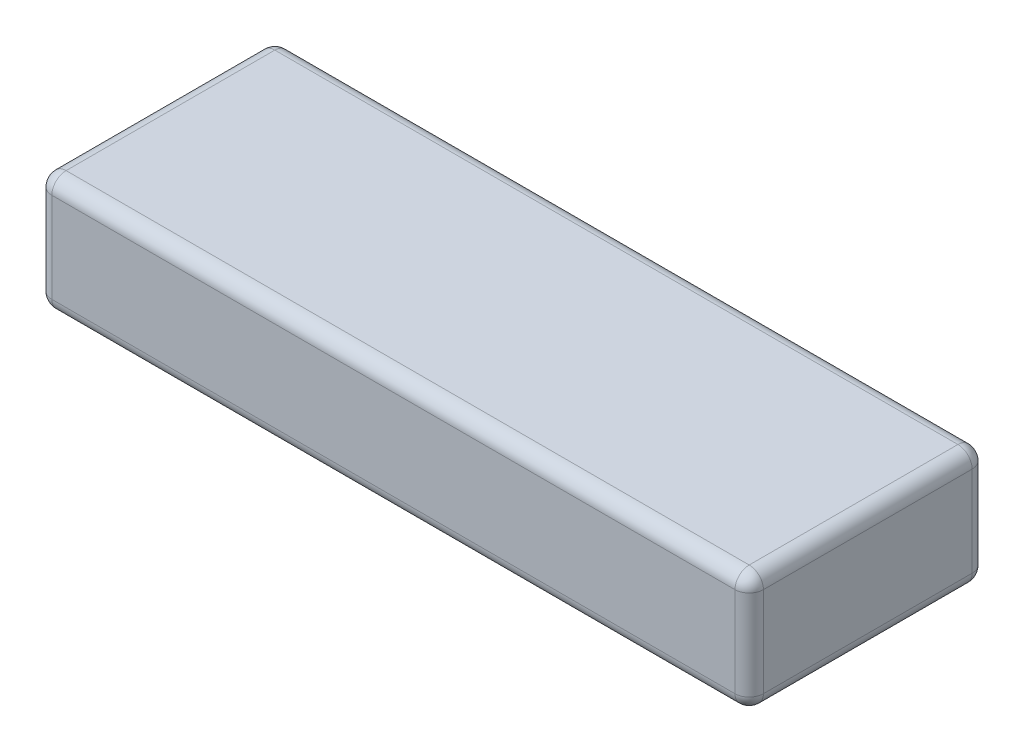
ISO-10303-21;
HEADER;
FILE_DESCRIPTION(('STEP AP214'),'2;1');
FILE_NAME('part.step','',(''),(''),'','','');
FILE_SCHEMA(('AUTOMOTIVE_DESIGN { 1 0 10303 214 1 1 1 1 }'));
ENDSEC;
DATA;
#1=APPLICATION_CONTEXT('core data for automotive mechanical design processes');
#2=APPLICATION_PROTOCOL_DEFINITION('international standard','automotive_design',2000,#1);
#3=PRODUCT_CONTEXT('',#1,'mechanical');
#4=PRODUCT('Part','Part','',(#3));
#5=PRODUCT_RELATED_PRODUCT_CATEGORY('part','',(#4));
#6=PRODUCT_DEFINITION_FORMATION('','',#4);
#7=PRODUCT_DEFINITION_CONTEXT('part definition',#1,'design');
#8=PRODUCT_DEFINITION('design','',#6,#7);
#9=PRODUCT_DEFINITION_SHAPE('','',#8);
#10=(LENGTH_UNIT() NAMED_UNIT(*) SI_UNIT(.MILLI.,.METRE.));
#11=(NAMED_UNIT(*) PLANE_ANGLE_UNIT() SI_UNIT($,.RADIAN.));
#12=(NAMED_UNIT(*) SI_UNIT($,.STERADIAN.) SOLID_ANGLE_UNIT());
#13=UNCERTAINTY_MEASURE_WITH_UNIT(LENGTH_MEASURE(1.E-05),#10,'distance_accuracy_value','');
#14=(GEOMETRIC_REPRESENTATION_CONTEXT(3) GLOBAL_UNCERTAINTY_ASSIGNED_CONTEXT((#13)) GLOBAL_UNIT_ASSIGNED_CONTEXT((#10,
#11,#12)) REPRESENTATION_CONTEXT('',''));
#15=CARTESIAN_POINT('',(0.,0.,0.));
#16=DIRECTION('',(0.,0.,1.));
#17=DIRECTION('',(1.,0.,0.));
#18=AXIS2_PLACEMENT_3D('',#15,#16,#17);
#19=CARTESIAN_POINT('',(0.,25.,0.));
#20=DIRECTION('',(1.,0.,0.));
#21=DIRECTION('',(0.,0.,-1.));
#22=AXIS2_PLACEMENT_3D('',#19,#20,#21);
#23=PLANE('',#22);
#24=DIRECTION('',(0.,0.,1.));
#25=VECTOR('',#24,1.);
#26=CARTESIAN_POINT('',(0.,22.,0.));
#27=LINE('',#26,#25);
#28=CARTESIAN_POINT('',(0.,22.,47.));
#29=VERTEX_POINT('',#28);
#30=CARTESIAN_POINT('',(0.,22.,3.));
#31=VERTEX_POINT('',#30);
#32=EDGE_CURVE('E273',#29,#31,#27,.F.);
#33=ORIENTED_EDGE('',*,*,#32,.T.);
#34=DIRECTION('',(0.,-1.,0.));
#35=VECTOR('',#34,1.);
#36=CARTESIAN_POINT('',(0.,25.,3.));
#37=LINE('',#36,#35);
#38=CARTESIAN_POINT('',(0.,3.,3.));
#39=VERTEX_POINT('',#38);
#40=EDGE_CURVE('E157',#31,#39,#37,.T.);
#41=ORIENTED_EDGE('',*,*,#40,.T.);
#42=DIRECTION('',(0.,0.,1.));
#43=VECTOR('',#42,1.);
#44=CARTESIAN_POINT('',(0.,3.,0.));
#45=LINE('',#44,#43);
#46=CARTESIAN_POINT('',(0.,3.,47.));
#47=VERTEX_POINT('',#46);
#48=EDGE_CURVE('E281',#39,#47,#45,.T.);
#49=ORIENTED_EDGE('',*,*,#48,.T.);
#50=DIRECTION('',(0.,-1.,0.));
#51=VECTOR('',#50,1.);
#52=CARTESIAN_POINT('',(0.,25.,47.));
#53=LINE('',#52,#51);
#54=EDGE_CURVE('E275',#47,#29,#53,.F.);
#55=ORIENTED_EDGE('',*,*,#54,.T.);
#56=EDGE_LOOP('',(#33,#41,#49,#55));
#57=FACE_BOUND('',#56,.T.);
#58=ADVANCED_FACE('F37',(#57),#23,.F.);
#59=CARTESIAN_POINT('',(0.,25.,50.));
#60=DIRECTION('',(0.,0.,-1.));
#61=DIRECTION('',(-1.,0.,0.));
#62=AXIS2_PLACEMENT_3D('',#59,#60,#61);
#63=PLANE('',#62);
#64=DIRECTION('',(1.,0.,0.));
#65=VECTOR('',#64,1.);
#66=CARTESIAN_POINT('',(0.,22.,50.));
#67=LINE('',#66,#65);
#68=CARTESIAN_POINT('',(147.,22.,50.));
#69=VERTEX_POINT('',#68);
#70=CARTESIAN_POINT('',(3.00000000000001,22.,50.));
#71=VERTEX_POINT('',#70);
#72=EDGE_CURVE('E284',#69,#71,#67,.F.);
#73=ORIENTED_EDGE('',*,*,#72,.T.);
#74=DIRECTION('',(0.,-1.,0.));
#75=VECTOR('',#74,1.);
#76=CARTESIAN_POINT('',(3.00000000000001,25.,50.));
#77=LINE('',#76,#75);
#78=CARTESIAN_POINT('',(3.00000000000001,3.,50.));
#79=VERTEX_POINT('',#78);
#80=EDGE_CURVE('E227',#71,#79,#77,.T.);
#81=ORIENTED_EDGE('',*,*,#80,.T.);
#82=DIRECTION('',(1.,0.,0.));
#83=VECTOR('',#82,1.);
#84=CARTESIAN_POINT('',(0.,3.,50.));
#85=LINE('',#84,#83);
#86=CARTESIAN_POINT('',(147.,3.,50.));
#87=VERTEX_POINT('',#86);
#88=EDGE_CURVE('E287',#79,#87,#85,.T.);
#89=ORIENTED_EDGE('',*,*,#88,.T.);
#90=DIRECTION('',(0.,-1.,0.));
#91=VECTOR('',#90,1.);
#92=CARTESIAN_POINT('',(147.,25.,50.));
#93=LINE('',#92,#91);
#94=EDGE_CURVE('E217',#87,#69,#93,.F.);
#95=ORIENTED_EDGE('',*,*,#94,.T.);
#96=EDGE_LOOP('',(#73,#81,#89,#95));
#97=FACE_BOUND('',#96,.T.);
#98=ADVANCED_FACE('F291',(#97),#63,.F.);
#99=CARTESIAN_POINT('',(150.,25.,0.));
#100=DIRECTION('',(-1.,0.,0.));
#101=DIRECTION('',(0.,0.,1.));
#102=AXIS2_PLACEMENT_3D('',#99,#100,#101);
#103=PLANE('',#102);
#104=DIRECTION('',(0.,0.,-1.));
#105=VECTOR('',#104,1.);
#106=CARTESIAN_POINT('',(150.,3.,0.));
#107=LINE('',#106,#105);
#108=CARTESIAN_POINT('',(150.,3.,47.));
#109=VERTEX_POINT('',#108);
#110=CARTESIAN_POINT('',(150.,3.,3.));
#111=VERTEX_POINT('',#110);
#112=EDGE_CURVE('E222',#109,#111,#107,.T.);
#113=ORIENTED_EDGE('',*,*,#112,.T.);
#114=DIRECTION('',(0.,-1.,0.));
#115=VECTOR('',#114,1.);
#116=CARTESIAN_POINT('',(150.,25.,3.));
#117=LINE('',#116,#115);
#118=CARTESIAN_POINT('',(150.,22.,3.));
#119=VERTEX_POINT('',#118);
#120=EDGE_CURVE('E225',#111,#119,#117,.F.);
#121=ORIENTED_EDGE('',*,*,#120,.T.);
#122=DIRECTION('',(0.,0.,-1.));
#123=VECTOR('',#122,1.);
#124=CARTESIAN_POINT('',(150.,22.,50.));
#125=LINE('',#124,#123);
#126=CARTESIAN_POINT('',(150.,22.,47.));
#127=VERTEX_POINT('',#126);
#128=EDGE_CURVE('E223',#119,#127,#125,.F.);
#129=ORIENTED_EDGE('',*,*,#128,.T.);
#130=DIRECTION('',(0.,-1.,0.));
#131=VECTOR('',#130,1.);
#132=CARTESIAN_POINT('',(150.,25.,47.));
#133=LINE('',#132,#131);
#134=EDGE_CURVE('E219',#127,#109,#133,.T.);
#135=ORIENTED_EDGE('',*,*,#134,.T.);
#136=EDGE_LOOP('',(#113,#121,#129,#135));
#137=FACE_BOUND('',#136,.T.);
#138=ADVANCED_FACE('F305',(#137),#103,.F.);
#139=CARTESIAN_POINT('',(0.,25.,0.));
#140=DIRECTION('',(0.,0.,1.));
#141=DIRECTION('',(1.,0.,0.));
#142=AXIS2_PLACEMENT_3D('',#139,#140,#141);
#143=PLANE('',#142);
#144=DIRECTION('',(0.,-1.,0.));
#145=VECTOR('',#144,1.);
#146=CARTESIAN_POINT('',(147.,25.,0.));
#147=LINE('',#146,#145);
#148=CARTESIAN_POINT('',(147.,22.,0.));
#149=VERTEX_POINT('',#148);
#150=CARTESIAN_POINT('',(147.,3.,0.));
#151=VERTEX_POINT('',#150);
#152=EDGE_CURVE('E138',#149,#151,#147,.T.);
#153=ORIENTED_EDGE('',*,*,#152,.T.);
#154=DIRECTION('',(-1.,0.,0.));
#155=VECTOR('',#154,1.);
#156=CARTESIAN_POINT('',(0.,3.,0.));
#157=LINE('',#156,#155);
#158=CARTESIAN_POINT('',(3.,3.,0.));
#159=VERTEX_POINT('',#158);
#160=EDGE_CURVE('E134',#151,#159,#157,.T.);
#161=ORIENTED_EDGE('',*,*,#160,.T.);
#162=DIRECTION('',(0.,-1.,0.));
#163=VECTOR('',#162,1.);
#164=CARTESIAN_POINT('',(3.,25.,0.));
#165=LINE('',#164,#163);
#166=CARTESIAN_POINT('',(3.,22.,0.));
#167=VERTEX_POINT('',#166);
#168=EDGE_CURVE('E129',#159,#167,#165,.F.);
#169=ORIENTED_EDGE('',*,*,#168,.T.);
#170=DIRECTION('',(-1.,0.,0.));
#171=VECTOR('',#170,1.);
#172=CARTESIAN_POINT('',(150.,22.,0.));
#173=LINE('',#172,#171);
#174=EDGE_CURVE('E132',#167,#149,#173,.F.);
#175=ORIENTED_EDGE('',*,*,#174,.T.);
#176=EDGE_LOOP('',(#153,#161,#169,#175));
#177=FACE_BOUND('',#176,.T.);
#178=ADVANCED_FACE('F131',(#177),#143,.F.);
#179=CARTESIAN_POINT('',(0.,25.,0.));
#180=DIRECTION('',(0.,1.,0.));
#181=DIRECTION('',(0.,0.,1.));
#182=AXIS2_PLACEMENT_3D('',#179,#180,#181);
#183=PLANE('',#182);
#184=DIRECTION('',(1.,0.,0.));
#185=VECTOR('',#184,1.);
#186=CARTESIAN_POINT('',(150.,25.,47.));
#187=LINE('',#186,#185);
#188=CARTESIAN_POINT('',(3.00000000000001,25.,47.));
#189=VERTEX_POINT('',#188);
#190=CARTESIAN_POINT('',(147.,25.,47.));
#191=VERTEX_POINT('',#190);
#192=EDGE_CURVE('E233',#189,#191,#187,.T.);
#193=ORIENTED_EDGE('',*,*,#192,.T.);
#194=DIRECTION('',(0.,0.,-1.));
#195=VECTOR('',#194,1.);
#196=CARTESIAN_POINT('',(147.,25.,0.));
#197=LINE('',#196,#195);
#198=CARTESIAN_POINT('',(147.,25.,3.));
#199=VERTEX_POINT('',#198);
#200=EDGE_CURVE('E11',#191,#199,#197,.T.);
#201=ORIENTED_EDGE('',*,*,#200,.T.);
#202=DIRECTION('',(-1.,0.,0.));
#203=VECTOR('',#202,1.);
#204=CARTESIAN_POINT('',(0.,25.,3.));
#205=LINE('',#204,#203);
#206=CARTESIAN_POINT('',(3.,25.,3.));
#207=VERTEX_POINT('',#206);
#208=EDGE_CURVE('E46',#199,#207,#205,.T.);
#209=ORIENTED_EDGE('',*,*,#208,.T.);
#210=DIRECTION('',(0.,0.,1.));
#211=VECTOR('',#210,1.);
#212=CARTESIAN_POINT('',(3.00000000000001,25.,50.));
#213=LINE('',#212,#211);
#214=EDGE_CURVE('E235',#207,#189,#213,.T.);
#215=ORIENTED_EDGE('',*,*,#214,.T.);
#216=EDGE_LOOP('',(#193,#201,#209,#215));
#217=FACE_BOUND('',#216,.T.);
#218=ADVANCED_FACE('F313',(#217),#183,.T.);
#219=CARTESIAN_POINT('',(0.,0.,0.));
#220=DIRECTION('',(0.,1.,0.));
#221=DIRECTION('',(0.,0.,1.));
#222=AXIS2_PLACEMENT_3D('',#219,#220,#221);
#223=PLANE('',#222);
#224=DIRECTION('',(0.,0.,1.));
#225=VECTOR('',#224,1.);
#226=CARTESIAN_POINT('',(3.,0.,0.));
#227=LINE('',#226,#225);
#228=CARTESIAN_POINT('',(3.00000000000001,0.,47.));
#229=VERTEX_POINT('',#228);
#230=CARTESIAN_POINT('',(3.,0.,3.));
#231=VERTEX_POINT('',#230);
#232=EDGE_CURVE('E269',#229,#231,#227,.F.);
#233=ORIENTED_EDGE('',*,*,#232,.T.);
#234=DIRECTION('',(-1.,0.,0.));
#235=VECTOR('',#234,1.);
#236=CARTESIAN_POINT('',(0.,0.,3.));
#237=LINE('',#236,#235);
#238=CARTESIAN_POINT('',(147.,0.,3.));
#239=VERTEX_POINT('',#238);
#240=EDGE_CURVE('E266',#231,#239,#237,.F.);
#241=ORIENTED_EDGE('',*,*,#240,.T.);
#242=DIRECTION('',(0.,0.,-1.));
#243=VECTOR('',#242,1.);
#244=CARTESIAN_POINT('',(147.,0.,0.));
#245=LINE('',#244,#243);
#246=CARTESIAN_POINT('',(147.,0.,47.));
#247=VERTEX_POINT('',#246);
#248=EDGE_CURVE('E258',#239,#247,#245,.F.);
#249=ORIENTED_EDGE('',*,*,#248,.T.);
#250=DIRECTION('',(1.,0.,0.));
#251=VECTOR('',#250,1.);
#252=CARTESIAN_POINT('',(0.,0.,47.));
#253=LINE('',#252,#251);
#254=EDGE_CURVE('E263',#247,#229,#253,.F.);
#255=ORIENTED_EDGE('',*,*,#254,.T.);
#256=EDGE_LOOP('',(#233,#241,#249,#255));
#257=FACE_BOUND('',#256,.T.);
#258=ADVANCED_FACE('F267',(#257),#223,.F.);
#259=CARTESIAN_POINT('',(0.,22.,47.));
#260=DIRECTION('',(-1.,0.,0.));
#261=DIRECTION('',(0.,0.,1.));
#262=AXIS2_PLACEMENT_3D('',#259,#260,#261);
#263=CYLINDRICAL_SURFACE('',#262,3.);
#264=CARTESIAN_POINT('',(147.,22.,47.));
#265=DIRECTION('',(1.,0.,0.));
#266=DIRECTION('',(0.,0.,-1.));
#267=AXIS2_PLACEMENT_3D('',#264,#265,#266);
#268=CIRCLE('',#267,3.);
#269=EDGE_CURVE('E41',#191,#69,#268,.T.);
#270=ORIENTED_EDGE('',*,*,#269,.F.);
#271=ORIENTED_EDGE('',*,*,#192,.F.);
#272=CARTESIAN_POINT('',(3.00000000000001,22.,47.));
#273=DIRECTION('',(-1.,0.,0.));
#274=DIRECTION('',(0.,0.,1.));
#275=AXIS2_PLACEMENT_3D('',#272,#273,#274);
#276=CIRCLE('',#275,3.);
#277=EDGE_CURVE('E196',#71,#189,#276,.T.);
#278=ORIENTED_EDGE('',*,*,#277,.F.);
#279=ORIENTED_EDGE('',*,*,#72,.F.);
#280=EDGE_LOOP('',(#270,#271,#278,#279));
#281=FACE_BOUND('',#280,.T.);
#282=ADVANCED_FACE('F39',(#281),#263,.T.);
#283=CARTESIAN_POINT('',(147.,22.,47.));
#284=DIRECTION('',(0.,0.,1.));
#285=DIRECTION('',(1.,0.,0.));
#286=AXIS2_PLACEMENT_3D('',#283,#284,#285);
#287=SPHERICAL_SURFACE('',#286,3.);
#288=CARTESIAN_POINT('',(147.,22.,47.));
#289=DIRECTION('',(0.,0.,1.));
#290=DIRECTION('',(1.,0.,0.));
#291=AXIS2_PLACEMENT_3D('',#288,#289,#290);
#292=CIRCLE('',#291,3.);
#293=EDGE_CURVE('E191',#191,#127,#292,.F.);
#294=ORIENTED_EDGE('',*,*,#293,.F.);
#295=ORIENTED_EDGE('',*,*,#269,.T.);
#296=CARTESIAN_POINT('',(147.,22.,47.));
#297=DIRECTION('',(0.,1.,0.));
#298=DIRECTION('',(0.,0.,1.));
#299=AXIS2_PLACEMENT_3D('',#296,#297,#298);
#300=CIRCLE('',#299,3.);
#301=EDGE_CURVE('E194',#127,#69,#300,.F.);
#302=ORIENTED_EDGE('',*,*,#301,.F.);
#303=EDGE_LOOP('',(#294,#295,#302));
#304=FACE_BOUND('',#303,.T.);
#305=ADVANCED_FACE('F207',(#304),#287,.T.);
#306=CARTESIAN_POINT('',(3.00000000000001,22.,47.));
#307=DIRECTION('',(0.,0.,1.));
#308=DIRECTION('',(1.,0.,0.));
#309=AXIS2_PLACEMENT_3D('',#306,#307,#308);
#310=SPHERICAL_SURFACE('',#309,3.);
#311=CARTESIAN_POINT('',(3.00000000000001,22.,47.));
#312=DIRECTION('',(0.,1.,0.));
#313=DIRECTION('',(0.,0.,1.));
#314=AXIS2_PLACEMENT_3D('',#311,#312,#313);
#315=CIRCLE('',#314,3.);
#316=EDGE_CURVE('E185',#71,#29,#315,.F.);
#317=ORIENTED_EDGE('',*,*,#316,.F.);
#318=ORIENTED_EDGE('',*,*,#277,.T.);
#319=CARTESIAN_POINT('',(3.00000000000001,22.,47.));
#320=DIRECTION('',(0.,0.,1.));
#321=DIRECTION('',(1.,0.,0.));
#322=AXIS2_PLACEMENT_3D('',#319,#320,#321);
#323=CIRCLE('',#322,3.);
#324=EDGE_CURVE('E188',#29,#189,#323,.F.);
#325=ORIENTED_EDGE('',*,*,#324,.F.);
#326=EDGE_LOOP('',(#317,#318,#325));
#327=FACE_BOUND('',#326,.T.);
#328=ADVANCED_FACE('F314',(#327),#310,.T.);
#329=CARTESIAN_POINT('',(147.,25.,47.));
#330=DIRECTION('',(0.,-1.,0.));
#331=DIRECTION('',(0.,0.,-1.));
#332=AXIS2_PLACEMENT_3D('',#329,#330,#331);
#333=CYLINDRICAL_SURFACE('',#332,3.);
#334=ORIENTED_EDGE('',*,*,#301,.T.);
#335=ORIENTED_EDGE('',*,*,#94,.F.);
#336=CARTESIAN_POINT('',(147.,3.,47.));
#337=DIRECTION('',(0.,-1.,0.));
#338=DIRECTION('',(0.,0.,-1.));
#339=AXIS2_PLACEMENT_3D('',#336,#337,#338);
#340=CIRCLE('',#339,3.);
#341=EDGE_CURVE('E179',#109,#87,#340,.T.);
#342=ORIENTED_EDGE('',*,*,#341,.F.);
#343=ORIENTED_EDGE('',*,*,#134,.F.);
#344=EDGE_LOOP('',(#334,#335,#342,#343));
#345=FACE_BOUND('',#344,.T.);
#346=ADVANCED_FACE('F215',(#345),#333,.T.);
#347=CARTESIAN_POINT('',(147.,22.,0.));
#348=DIRECTION('',(0.,0.,1.));
#349=DIRECTION('',(1.,0.,0.));
#350=AXIS2_PLACEMENT_3D('',#347,#348,#349);
#351=CYLINDRICAL_SURFACE('',#350,3.);
#352=ORIENTED_EDGE('',*,*,#293,.T.);
#353=ORIENTED_EDGE('',*,*,#128,.F.);
#354=CARTESIAN_POINT('',(147.,22.,3.));
#355=DIRECTION('',(0.,0.,-1.));
#356=DIRECTION('',(-1.,0.,0.));
#357=AXIS2_PLACEMENT_3D('',#354,#355,#356);
#358=CIRCLE('',#357,3.);
#359=EDGE_CURVE('E177',#199,#119,#358,.T.);
#360=ORIENTED_EDGE('',*,*,#359,.F.);
#361=ORIENTED_EDGE('',*,*,#200,.F.);
#362=EDGE_LOOP('',(#352,#353,#360,#361));
#363=FACE_BOUND('',#362,.T.);
#364=ADVANCED_FACE('F312',(#363),#351,.T.);
#365=CARTESIAN_POINT('',(0.,22.,3.));
#366=DIRECTION('',(1.,0.,0.));
#367=DIRECTION('',(0.,0.,-1.));
#368=AXIS2_PLACEMENT_3D('',#365,#366,#367);
#369=CYLINDRICAL_SURFACE('',#368,3.);
#370=CARTESIAN_POINT('',(3.,22.,3.));
#371=DIRECTION('',(-1.,0.,0.));
#372=DIRECTION('',(0.,0.,1.));
#373=AXIS2_PLACEMENT_3D('',#370,#371,#372);
#374=CIRCLE('',#373,3.);
#375=EDGE_CURVE('E144',#207,#167,#374,.T.);
#376=ORIENTED_EDGE('',*,*,#375,.F.);
#377=ORIENTED_EDGE('',*,*,#208,.F.);
#378=CARTESIAN_POINT('',(147.,22.,3.));
#379=DIRECTION('',(1.,0.,0.));
#380=DIRECTION('',(0.,0.,-1.));
#381=AXIS2_PLACEMENT_3D('',#378,#379,#380);
#382=CIRCLE('',#381,3.);
#383=EDGE_CURVE('E54',#149,#199,#382,.T.);
#384=ORIENTED_EDGE('',*,*,#383,.F.);
#385=ORIENTED_EDGE('',*,*,#174,.F.);
#386=EDGE_LOOP('',(#376,#377,#384,#385));
#387=FACE_BOUND('',#386,.T.);
#388=ADVANCED_FACE('F143',(#387),#369,.T.);
#389=CARTESIAN_POINT('',(3.,22.,0.));
#390=DIRECTION('',(0.,0.,-1.));
#391=DIRECTION('',(-1.,0.,0.));
#392=AXIS2_PLACEMENT_3D('',#389,#390,#391);
#393=CYLINDRICAL_SURFACE('',#392,3.);
#394=ORIENTED_EDGE('',*,*,#324,.T.);
#395=ORIENTED_EDGE('',*,*,#214,.F.);
#396=CARTESIAN_POINT('',(3.,22.,3.));
#397=DIRECTION('',(0.,0.,-1.));
#398=DIRECTION('',(-1.,0.,0.));
#399=AXIS2_PLACEMENT_3D('',#396,#397,#398);
#400=CIRCLE('',#399,3.);
#401=EDGE_CURVE('E153',#31,#207,#400,.T.);
#402=ORIENTED_EDGE('',*,*,#401,.F.);
#403=ORIENTED_EDGE('',*,*,#32,.F.);
#404=EDGE_LOOP('',(#394,#395,#402,#403));
#405=FACE_BOUND('',#404,.T.);
#406=ADVANCED_FACE('F317',(#405),#393,.T.);
#407=CARTESIAN_POINT('',(3.00000000000001,25.,47.));
#408=DIRECTION('',(0.,-1.,0.));
#409=DIRECTION('',(0.,0.,-1.));
#410=AXIS2_PLACEMENT_3D('',#407,#408,#409);
#411=CYLINDRICAL_SURFACE('',#410,3.);
#412=ORIENTED_EDGE('',*,*,#316,.T.);
#413=ORIENTED_EDGE('',*,*,#54,.F.);
#414=CARTESIAN_POINT('',(3.00000000000001,3.,47.));
#415=DIRECTION('',(0.,-1.,0.));
#416=DIRECTION('',(0.,0.,-1.));
#417=AXIS2_PLACEMENT_3D('',#414,#415,#416);
#418=CIRCLE('',#417,3.);
#419=EDGE_CURVE('E172',#79,#47,#418,.T.);
#420=ORIENTED_EDGE('',*,*,#419,.F.);
#421=ORIENTED_EDGE('',*,*,#80,.F.);
#422=EDGE_LOOP('',(#412,#413,#420,#421));
#423=FACE_BOUND('',#422,.T.);
#424=ADVANCED_FACE('F295',(#423),#411,.T.);
#425=CARTESIAN_POINT('',(0.,3.,47.));
#426=DIRECTION('',(1.,0.,0.));
#427=DIRECTION('',(0.,0.,-1.));
#428=AXIS2_PLACEMENT_3D('',#425,#426,#427);
#429=CYLINDRICAL_SURFACE('',#428,3.);
#430=CARTESIAN_POINT('',(147.,3.,47.));
#431=DIRECTION('',(1.,0.,0.));
#432=DIRECTION('',(0.,0.,-1.));
#433=AXIS2_PLACEMENT_3D('',#430,#431,#432);
#434=CIRCLE('',#433,3.);
#435=EDGE_CURVE('E182',#87,#247,#434,.T.);
#436=ORIENTED_EDGE('',*,*,#435,.F.);
#437=ORIENTED_EDGE('',*,*,#88,.F.);
#438=CARTESIAN_POINT('',(3.00000000000001,3.,47.));
#439=DIRECTION('',(-1.,0.,0.));
#440=DIRECTION('',(0.,0.,1.));
#441=AXIS2_PLACEMENT_3D('',#438,#439,#440);
#442=CIRCLE('',#441,3.);
#443=EDGE_CURVE('E170',#229,#79,#442,.T.);
#444=ORIENTED_EDGE('',*,*,#443,.F.);
#445=ORIENTED_EDGE('',*,*,#254,.F.);
#446=EDGE_LOOP('',(#436,#437,#444,#445));
#447=FACE_BOUND('',#446,.T.);
#448=ADVANCED_FACE('F301',(#447),#429,.T.);
#449=CARTESIAN_POINT('',(147.,3.,47.));
#450=DIRECTION('',(0.,0.,1.));
#451=DIRECTION('',(1.,0.,0.));
#452=AXIS2_PLACEMENT_3D('',#449,#450,#451);
#453=SPHERICAL_SURFACE('',#452,3.);
#454=ORIENTED_EDGE('',*,*,#341,.T.);
#455=ORIENTED_EDGE('',*,*,#435,.T.);
#456=CARTESIAN_POINT('',(147.,3.,47.));
#457=DIRECTION('',(0.,0.,1.));
#458=DIRECTION('',(1.,0.,0.));
#459=AXIS2_PLACEMENT_3D('',#456,#457,#458);
#460=CIRCLE('',#459,3.);
#461=EDGE_CURVE('E161',#109,#247,#460,.F.);
#462=ORIENTED_EDGE('',*,*,#461,.F.);
#463=EDGE_LOOP('',(#454,#455,#462));
#464=FACE_BOUND('',#463,.T.);
#465=ADVANCED_FACE('F303',(#464),#453,.T.);
#466=CARTESIAN_POINT('',(147.,22.,3.));
#467=DIRECTION('',(0.,0.,1.));
#468=DIRECTION('',(1.,0.,0.));
#469=AXIS2_PLACEMENT_3D('',#466,#467,#468);
#470=SPHERICAL_SURFACE('',#469,3.);
#471=ORIENTED_EDGE('',*,*,#383,.T.);
#472=ORIENTED_EDGE('',*,*,#359,.T.);
#473=CARTESIAN_POINT('',(147.,22.,3.));
#474=DIRECTION('',(0.,1.,0.));
#475=DIRECTION('',(0.,0.,1.));
#476=AXIS2_PLACEMENT_3D('',#473,#474,#475);
#477=CIRCLE('',#476,3.);
#478=EDGE_CURVE('E158',#149,#119,#477,.F.);
#479=ORIENTED_EDGE('',*,*,#478,.F.);
#480=EDGE_LOOP('',(#471,#472,#479));
#481=FACE_BOUND('',#480,.T.);
#482=ADVANCED_FACE('F310',(#481),#470,.T.);
#483=CARTESIAN_POINT('',(3.,22.,3.));
#484=DIRECTION('',(0.,0.,1.));
#485=DIRECTION('',(1.,0.,0.));
#486=AXIS2_PLACEMENT_3D('',#483,#484,#485);
#487=SPHERICAL_SURFACE('',#486,3.);
#488=ORIENTED_EDGE('',*,*,#401,.T.);
#489=ORIENTED_EDGE('',*,*,#375,.T.);
#490=CARTESIAN_POINT('',(3.,22.,3.));
#491=DIRECTION('',(0.,1.,0.));
#492=DIRECTION('',(0.,0.,1.));
#493=AXIS2_PLACEMENT_3D('',#490,#491,#492);
#494=CIRCLE('',#493,3.);
#495=EDGE_CURVE('E150',#31,#167,#494,.F.);
#496=ORIENTED_EDGE('',*,*,#495,.F.);
#497=EDGE_LOOP('',(#488,#489,#496));
#498=FACE_BOUND('',#497,.T.);
#499=ADVANCED_FACE('F149',(#498),#487,.T.);
#500=CARTESIAN_POINT('',(3.00000000000001,3.,47.));
#501=DIRECTION('',(0.,0.,1.));
#502=DIRECTION('',(1.,0.,0.));
#503=AXIS2_PLACEMENT_3D('',#500,#501,#502);
#504=SPHERICAL_SURFACE('',#503,3.);
#505=ORIENTED_EDGE('',*,*,#443,.T.);
#506=ORIENTED_EDGE('',*,*,#419,.T.);
#507=CARTESIAN_POINT('',(3.00000000000001,3.,47.));
#508=DIRECTION('',(0.,0.,1.));
#509=DIRECTION('',(1.,0.,0.));
#510=AXIS2_PLACEMENT_3D('',#507,#508,#509);
#511=CIRCLE('',#510,3.);
#512=EDGE_CURVE('E159',#229,#47,#511,.F.);
#513=ORIENTED_EDGE('',*,*,#512,.F.);
#514=EDGE_LOOP('',(#505,#506,#513));
#515=FACE_BOUND('',#514,.T.);
#516=ADVANCED_FACE('F322',(#515),#504,.T.);
#517=CARTESIAN_POINT('',(147.,3.,0.));
#518=DIRECTION('',(0.,0.,-1.));
#519=DIRECTION('',(-1.,0.,0.));
#520=AXIS2_PLACEMENT_3D('',#517,#518,#519);
#521=CYLINDRICAL_SURFACE('',#520,3.);
#522=ORIENTED_EDGE('',*,*,#461,.T.);
#523=ORIENTED_EDGE('',*,*,#248,.F.);
#524=CARTESIAN_POINT('',(147.,3.,3.));
#525=DIRECTION('',(0.,0.,-1.));
#526=DIRECTION('',(-1.,0.,0.));
#527=AXIS2_PLACEMENT_3D('',#524,#525,#526);
#528=CIRCLE('',#527,3.);
#529=EDGE_CURVE('E164',#111,#239,#528,.T.);
#530=ORIENTED_EDGE('',*,*,#529,.F.);
#531=ORIENTED_EDGE('',*,*,#112,.F.);
#532=EDGE_LOOP('',(#522,#523,#530,#531));
#533=FACE_BOUND('',#532,.T.);
#534=ADVANCED_FACE('F260',(#533),#521,.T.);
#535=CARTESIAN_POINT('',(147.,25.,3.));
#536=DIRECTION('',(0.,-1.,0.));
#537=DIRECTION('',(0.,0.,-1.));
#538=AXIS2_PLACEMENT_3D('',#535,#536,#537);
#539=CYLINDRICAL_SURFACE('',#538,3.);
#540=ORIENTED_EDGE('',*,*,#478,.T.);
#541=ORIENTED_EDGE('',*,*,#120,.F.);
#542=CARTESIAN_POINT('',(147.,3.,3.));
#543=DIRECTION('',(0.,-1.,0.));
#544=DIRECTION('',(0.,0.,-1.));
#545=AXIS2_PLACEMENT_3D('',#542,#543,#544);
#546=CIRCLE('',#545,3.);
#547=EDGE_CURVE('E247',#151,#111,#546,.T.);
#548=ORIENTED_EDGE('',*,*,#547,.F.);
#549=ORIENTED_EDGE('',*,*,#152,.F.);
#550=EDGE_LOOP('',(#540,#541,#548,#549));
#551=FACE_BOUND('',#550,.T.);
#552=ADVANCED_FACE('F307',(#551),#539,.T.);
#553=CARTESIAN_POINT('',(3.,25.,3.));
#554=DIRECTION('',(0.,-1.,0.));
#555=DIRECTION('',(0.,0.,-1.));
#556=AXIS2_PLACEMENT_3D('',#553,#554,#555);
#557=CYLINDRICAL_SURFACE('',#556,3.);
#558=ORIENTED_EDGE('',*,*,#495,.T.);
#559=ORIENTED_EDGE('',*,*,#168,.F.);
#560=CARTESIAN_POINT('',(3.,3.,3.));
#561=DIRECTION('',(0.,-1.,0.));
#562=DIRECTION('',(0.,0.,-1.));
#563=AXIS2_PLACEMENT_3D('',#560,#561,#562);
#564=CIRCLE('',#563,3.);
#565=EDGE_CURVE('E244',#39,#159,#564,.T.);
#566=ORIENTED_EDGE('',*,*,#565,.F.);
#567=ORIENTED_EDGE('',*,*,#40,.F.);
#568=EDGE_LOOP('',(#558,#559,#566,#567));
#569=FACE_BOUND('',#568,.T.);
#570=ADVANCED_FACE('F155',(#569),#557,.T.);
#571=CARTESIAN_POINT('',(3.,3.,0.));
#572=DIRECTION('',(0.,0.,1.));
#573=DIRECTION('',(1.,0.,0.));
#574=AXIS2_PLACEMENT_3D('',#571,#572,#573);
#575=CYLINDRICAL_SURFACE('',#574,3.);
#576=ORIENTED_EDGE('',*,*,#512,.T.);
#577=ORIENTED_EDGE('',*,*,#48,.F.);
#578=CARTESIAN_POINT('',(3.,3.,3.));
#579=DIRECTION('',(0.,0.,-1.));
#580=DIRECTION('',(-1.,0.,0.));
#581=AXIS2_PLACEMENT_3D('',#578,#579,#580);
#582=CIRCLE('',#581,3.);
#583=EDGE_CURVE('E242',#231,#39,#582,.T.);
#584=ORIENTED_EDGE('',*,*,#583,.F.);
#585=ORIENTED_EDGE('',*,*,#232,.F.);
#586=EDGE_LOOP('',(#576,#577,#584,#585));
#587=FACE_BOUND('',#586,.T.);
#588=ADVANCED_FACE('F321',(#587),#575,.T.);
#589=CARTESIAN_POINT('',(147.,3.,3.));
#590=DIRECTION('',(0.,0.,1.));
#591=DIRECTION('',(1.,0.,0.));
#592=AXIS2_PLACEMENT_3D('',#589,#590,#591);
#593=SPHERICAL_SURFACE('',#592,3.);
#594=ORIENTED_EDGE('',*,*,#547,.T.);
#595=ORIENTED_EDGE('',*,*,#529,.T.);
#596=CARTESIAN_POINT('',(147.,3.,3.));
#597=DIRECTION('',(1.,0.,0.));
#598=DIRECTION('',(0.,0.,-1.));
#599=AXIS2_PLACEMENT_3D('',#596,#597,#598);
#600=CIRCLE('',#599,3.);
#601=EDGE_CURVE('E240',#151,#239,#600,.F.);
#602=ORIENTED_EDGE('',*,*,#601,.F.);
#603=EDGE_LOOP('',(#594,#595,#602));
#604=FACE_BOUND('',#603,.T.);
#605=ADVANCED_FACE('F254',(#604),#593,.T.);
#606=CARTESIAN_POINT('',(3.,3.,3.));
#607=DIRECTION('',(0.,0.,1.));
#608=DIRECTION('',(1.,0.,0.));
#609=AXIS2_PLACEMENT_3D('',#606,#607,#608);
#610=SPHERICAL_SURFACE('',#609,3.);
#611=ORIENTED_EDGE('',*,*,#583,.T.);
#612=ORIENTED_EDGE('',*,*,#565,.T.);
#613=CARTESIAN_POINT('',(3.,3.,3.));
#614=DIRECTION('',(-1.,0.,0.));
#615=DIRECTION('',(0.,0.,1.));
#616=AXIS2_PLACEMENT_3D('',#613,#614,#615);
#617=CIRCLE('',#616,3.);
#618=EDGE_CURVE('E238',#231,#159,#617,.F.);
#619=ORIENTED_EDGE('',*,*,#618,.F.);
#620=EDGE_LOOP('',(#611,#612,#619));
#621=FACE_BOUND('',#620,.T.);
#622=ADVANCED_FACE('F342',(#621),#610,.T.);
#623=CARTESIAN_POINT('',(0.,3.,3.));
#624=DIRECTION('',(-1.,0.,0.));
#625=DIRECTION('',(0.,0.,1.));
#626=AXIS2_PLACEMENT_3D('',#623,#624,#625);
#627=CYLINDRICAL_SURFACE('',#626,3.);
#628=ORIENTED_EDGE('',*,*,#601,.T.);
#629=ORIENTED_EDGE('',*,*,#240,.F.);
#630=ORIENTED_EDGE('',*,*,#618,.T.);
#631=ORIENTED_EDGE('',*,*,#160,.F.);
#632=EDGE_LOOP('',(#628,#629,#630,#631));
#633=FACE_BOUND('',#632,.T.);
#634=ADVANCED_FACE('F339',(#633),#627,.T.);
#635=CLOSED_SHELL('',(#58,#98,#138,#178,#218,#258,#282,#305,#328,#346,#364,#388,#406,#424,#448,
#465,#482,#499,#516,#534,#552,#570,#588,#605,#622,#634));
#636=MANIFOLD_SOLID_BREP('B2',#635);
#637=ADVANCED_BREP_SHAPE_REPRESENTATION('',(#18,#636),#14);
#638=SHAPE_DEFINITION_REPRESENTATION(#9,#637);
ENDSEC;
END-ISO-10303-21;
